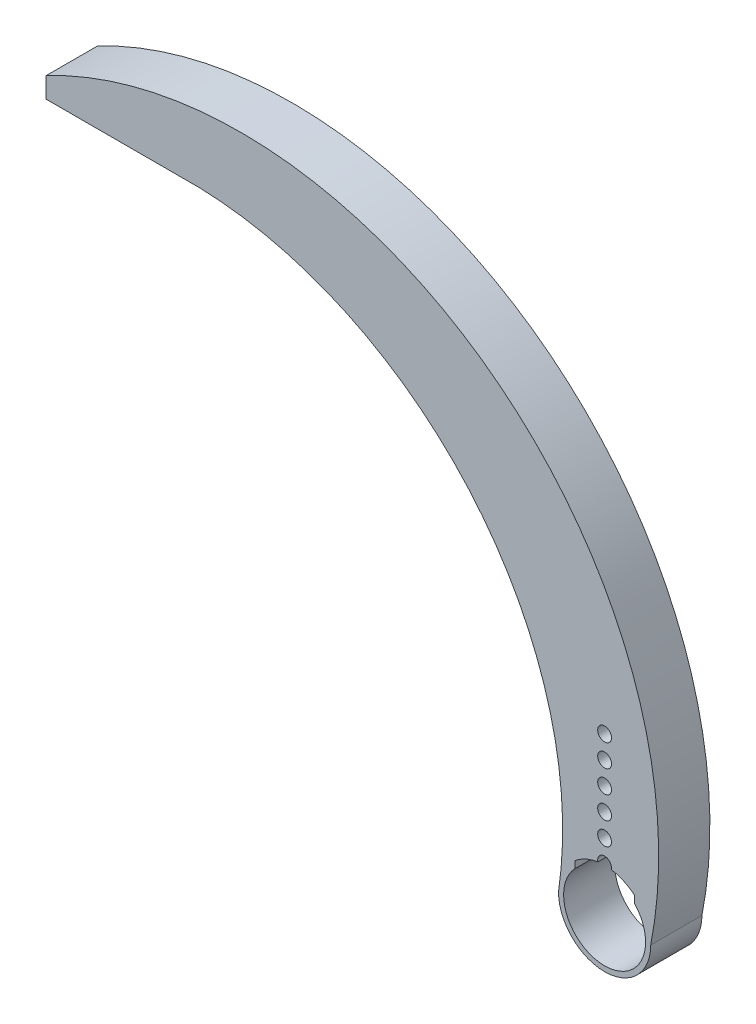
ISO-10303-21;
HEADER;
FILE_DESCRIPTION(('STEP AP214'),'2;1');
FILE_NAME('part.step','',(''),(''),'','','');
FILE_SCHEMA(('AUTOMOTIVE_DESIGN { 1 0 10303 214 1 1 1 1 }'));
ENDSEC;
DATA;
#1=APPLICATION_CONTEXT('core data for automotive mechanical design processes');
#2=APPLICATION_PROTOCOL_DEFINITION('international standard','automotive_design',2000,#1);
#3=PRODUCT_CONTEXT('',#1,'mechanical');
#4=PRODUCT('Part','Part','',(#3));
#5=PRODUCT_RELATED_PRODUCT_CATEGORY('part','',(#4));
#6=PRODUCT_DEFINITION_FORMATION('','',#4);
#7=PRODUCT_DEFINITION_CONTEXT('part definition',#1,'design');
#8=PRODUCT_DEFINITION('design','',#6,#7);
#9=PRODUCT_DEFINITION_SHAPE('','',#8);
#10=(LENGTH_UNIT() NAMED_UNIT(*) SI_UNIT(.MILLI.,.METRE.));
#11=(NAMED_UNIT(*) PLANE_ANGLE_UNIT() SI_UNIT($,.RADIAN.));
#12=(NAMED_UNIT(*) SI_UNIT($,.STERADIAN.) SOLID_ANGLE_UNIT());
#13=UNCERTAINTY_MEASURE_WITH_UNIT(LENGTH_MEASURE(1.E-05),#10,'distance_accuracy_value','');
#14=(GEOMETRIC_REPRESENTATION_CONTEXT(3) GLOBAL_UNCERTAINTY_ASSIGNED_CONTEXT((#13)) GLOBAL_UNIT_ASSIGNED_CONTEXT((#10,
#11,#12)) REPRESENTATION_CONTEXT('',''));
#15=CARTESIAN_POINT('',(0.,0.,0.));
#16=DIRECTION('',(0.,0.,1.));
#17=DIRECTION('',(1.,0.,0.));
#18=AXIS2_PLACEMENT_3D('',#15,#16,#17);
#19=CARTESIAN_POINT('',(2.90000010022773,1.12208217675132E-07,5.));
#20=DIRECTION('',(-0.999999999999999,-3.86924875162317E-08,0.));
#21=DIRECTION('',(3.86924875162317E-08,-0.999999999999999,0.));
#22=AXIS2_PLACEMENT_3D('',#19,#20,#21);
#23=PLANE('',#22);
#24=DIRECTION('',(-3.86924875162317E-08,0.999999999999999,0.));
#25=VECTOR('',#24,1.);
#26=CARTESIAN_POINT('',(2.90000010022773,1.12208217675132E-07,5.));
#27=LINE('',#26,#25);
#28=CARTESIAN_POINT('',(2.89999999363011,2.75499546949634,5.));
#29=VERTEX_POINT('',#28);
#30=CARTESIAN_POINT('',(2.89999996708959,3.44093013455379,5.));
#31=VERTEX_POINT('',#30);
#32=EDGE_CURVE('E338',#29,#31,#27,.T.);
#33=ORIENTED_EDGE('',*,*,#32,.T.);
#34=DIRECTION('',(0.,0.,1.));
#35=VECTOR('',#34,1.);
#36=CARTESIAN_POINT('',(2.89999996708959,3.44093013455379,2.5));
#37=LINE('',#36,#35);
#38=CARTESIAN_POINT('',(2.89999996708959,3.4409300790803,2.5));
#39=VERTEX_POINT('',#38);
#40=EDGE_CURVE('E193',#39,#31,#37,.T.);
#41=ORIENTED_EDGE('',*,*,#40,.F.);
#42=DIRECTION('',(3.86924875162317E-08,-0.999999999999999,0.));
#43=VECTOR('',#42,1.);
#44=CARTESIAN_POINT('',(2.90000010022773,1.12208217675132E-07,2.5));
#45=LINE('',#44,#43);
#46=CARTESIAN_POINT('',(2.89999996061248,3.60832972665632,2.5));
#47=VERTEX_POINT('',#46);
#48=EDGE_CURVE('E293',#47,#39,#45,.T.);
#49=ORIENTED_EDGE('',*,*,#48,.F.);
#50=DIRECTION('',(0.,0.,-1.));
#51=VECTOR('',#50,1.);
#52=CARTESIAN_POINT('',(2.89999996061248,3.60832972665632,5.));
#53=LINE('',#52,#51);
#54=CARTESIAN_POINT('',(2.89999996061248,3.60832972665632,0.));
#55=VERTEX_POINT('',#54);
#56=EDGE_CURVE('E367',#47,#55,#53,.T.);
#57=ORIENTED_EDGE('',*,*,#56,.T.);
#58=DIRECTION('',(-3.86924875162317E-08,0.999999999999999,0.));
#59=VECTOR('',#58,1.);
#60=CARTESIAN_POINT('',(2.90000010022773,1.12208217675132E-07,0.));
#61=LINE('',#60,#59);
#62=CARTESIAN_POINT('',(2.89999999363011,2.75499546949634,0.));
#63=VERTEX_POINT('',#62);
#64=EDGE_CURVE('E337',#63,#55,#61,.T.);
#65=ORIENTED_EDGE('',*,*,#64,.F.);
#66=DIRECTION('',(0.,0.,-1.));
#67=VECTOR('',#66,1.);
#68=CARTESIAN_POINT('',(2.89999999363011,2.75499546949634,5.));
#69=LINE('',#68,#67);
#70=EDGE_CURVE('E179',#29,#63,#69,.T.);
#71=ORIENTED_EDGE('',*,*,#70,.F.);
#72=EDGE_LOOP('',(#33,#41,#49,#57,#65,#71));
#73=FACE_BOUND('',#72,.T.);
#74=ADVANCED_FACE('F176',(#73),#23,.T.);
#75=CARTESIAN_POINT('',(-2.89999989977228,-1.12208202649701E-07,5.));
#76=DIRECTION('',(0.999999999999999,3.86924850095727E-08,0.));
#77=DIRECTION('',(-3.86924850095727E-08,0.999999999999999,0.));
#78=AXIS2_PLACEMENT_3D('',#75,#76,#77);
#79=PLANE('',#78);
#80=DIRECTION('',(-3.86924850095727E-08,0.999999999999999,0.));
#81=VECTOR('',#80,1.);
#82=CARTESIAN_POINT('',(-2.89999989977228,-1.12208202649701E-07,2.5));
#83=LINE('',#82,#81);
#84=CARTESIAN_POINT('',(-2.90000003291042,3.4409300790803,2.5));
#85=VERTEX_POINT('',#84);
#86=CARTESIAN_POINT('',(-2.90000003938752,3.6083297124865,2.5));
#87=VERTEX_POINT('',#86);
#88=EDGE_CURVE('E201',#85,#87,#83,.T.);
#89=ORIENTED_EDGE('',*,*,#88,.F.);
#90=DIRECTION('',(0.,0.,1.));
#91=VECTOR('',#90,1.);
#92=CARTESIAN_POINT('',(-2.90000003291042,3.4409300790803,2.5));
#93=LINE('',#92,#91);
#94=CARTESIAN_POINT('',(-2.90000003291042,3.4409300790803,5.));
#95=VERTEX_POINT('',#94);
#96=EDGE_CURVE('E319',#85,#95,#93,.T.);
#97=ORIENTED_EDGE('',*,*,#96,.T.);
#98=DIRECTION('',(3.86924850095727E-08,-0.999999999999999,0.));
#99=VECTOR('',#98,1.);
#100=CARTESIAN_POINT('',(-2.89999989977228,-1.12208202649701E-07,5.));
#101=LINE('',#100,#99);
#102=CARTESIAN_POINT('',(-2.9000000063699,2.75499545608601,5.));
#103=VERTEX_POINT('',#102);
#104=EDGE_CURVE('E346',#95,#103,#101,.T.);
#105=ORIENTED_EDGE('',*,*,#104,.T.);
#106=DIRECTION('',(0.,0.,-1.));
#107=VECTOR('',#106,1.);
#108=CARTESIAN_POINT('',(-2.9000000063699,2.75499545608601,5.));
#109=LINE('',#108,#107);
#110=CARTESIAN_POINT('',(-2.9000000063699,2.75499545608601,0.));
#111=VERTEX_POINT('',#110);
#112=EDGE_CURVE('E432',#103,#111,#109,.T.);
#113=ORIENTED_EDGE('',*,*,#112,.T.);
#114=DIRECTION('',(3.86924850095727E-08,-0.999999999999999,0.));
#115=VECTOR('',#114,1.);
#116=CARTESIAN_POINT('',(-2.89999989977228,-1.12208202649701E-07,0.));
#117=LINE('',#116,#115);
#118=CARTESIAN_POINT('',(-2.90000003938752,3.6083297124865,0.));
#119=VERTEX_POINT('',#118);
#120=EDGE_CURVE('E375',#119,#111,#117,.T.);
#121=ORIENTED_EDGE('',*,*,#120,.F.);
#122=DIRECTION('',(0.,0.,-1.));
#123=VECTOR('',#122,1.);
#124=CARTESIAN_POINT('',(-2.90000003938752,3.6083297124865,5.));
#125=LINE('',#124,#123);
#126=EDGE_CURVE('E430',#87,#119,#125,.T.);
#127=ORIENTED_EDGE('',*,*,#126,.F.);
#128=EDGE_LOOP('',(#89,#97,#105,#113,#121,#127));
#129=FACE_BOUND('',#128,.T.);
#130=ADVANCED_FACE('F449',(#129),#79,.T.);
#131=CARTESIAN_POINT('',(-3.04506055819265,0.126877533171024,5.));
#132=DIRECTION('',(0.999133072957061,-0.0416305479591573,0.));
#133=DIRECTION('',(0.0416305479591573,0.999133072957061,0.));
#134=AXIS2_PLACEMENT_3D('',#131,#132,#133);
#135=PLANE('',#134);
#136=DIRECTION('',(0.,0.,-1.));
#137=VECTOR('',#136,1.);
#138=CARTESIAN_POINT('',(-2.3999841987356,15.6087089505378,5.));
#139=LINE('',#138,#137);
#140=CARTESIAN_POINT('',(-2.3999841987356,15.6087089505378,2.5));
#141=VERTEX_POINT('',#140);
#142=CARTESIAN_POINT('',(-2.3999841987356,15.6087089505378,0.));
#143=VERTEX_POINT('',#142);
#144=EDGE_CURVE('E427',#141,#143,#139,.T.);
#145=ORIENTED_EDGE('',*,*,#144,.F.);
#146=DIRECTION('',(0.0416305479591573,0.999133072957061,0.));
#147=VECTOR('',#146,1.);
#148=CARTESIAN_POINT('',(-3.04506055819264,0.126877533171024,2.5));
#149=LINE('',#148,#147);
#150=EDGE_CURVE('E330',#87,#141,#149,.T.);
#151=ORIENTED_EDGE('',*,*,#150,.F.);
#152=ORIENTED_EDGE('',*,*,#126,.T.);
#153=DIRECTION('',(-0.0416305479591573,-0.999133072957061,0.));
#154=VECTOR('',#153,1.);
#155=CARTESIAN_POINT('',(-3.04506055819265,0.126877533171024,0.));
#156=LINE('',#155,#154);
#157=EDGE_CURVE('E379',#143,#119,#156,.T.);
#158=ORIENTED_EDGE('',*,*,#157,.F.);
#159=EDGE_LOOP('',(#145,#151,#152,#158));
#160=FACE_BOUND('',#159,.T.);
#161=ADVANCED_FACE('F510',(#160),#135,.T.);
#162=CARTESIAN_POINT('',(0.,15.6,5.));
#163=DIRECTION('',(0.,0.,-1.));
#164=DIRECTION('',(-1.,0.,0.));
#165=AXIS2_PLACEMENT_3D('',#162,#163,#164);
#166=CYLINDRICAL_SURFACE('',#165,2.4);
#167=DIRECTION('',(0.,0.,-1.));
#168=VECTOR('',#167,1.);
#169=CARTESIAN_POINT('',(2.39998419874053,15.6087089491782,5.));
#170=LINE('',#169,#168);
#171=CARTESIAN_POINT('',(2.39998419874053,15.6087089491782,2.5));
#172=VERTEX_POINT('',#171);
#173=CARTESIAN_POINT('',(2.39998419874053,15.6087089491782,0.));
#174=VERTEX_POINT('',#173);
#175=EDGE_CURVE('E424',#172,#174,#170,.T.);
#176=ORIENTED_EDGE('',*,*,#175,.F.);
#177=CARTESIAN_POINT('',(0.,15.6,2.5));
#178=DIRECTION('',(0.,0.,1.));
#179=DIRECTION('',(1.,0.,0.));
#180=AXIS2_PLACEMENT_3D('',#177,#178,#179);
#181=CIRCLE('',#180,2.4);
#182=EDGE_CURVE('E497',#172,#141,#181,.T.);
#183=ORIENTED_EDGE('',*,*,#182,.T.);
#184=ORIENTED_EDGE('',*,*,#144,.T.);
#185=CARTESIAN_POINT('',(0.,15.6,0.));
#186=DIRECTION('',(0.,0.,1.));
#187=DIRECTION('',(1.,0.,0.));
#188=AXIS2_PLACEMENT_3D('',#185,#186,#187);
#189=CIRCLE('',#188,2.4);
#190=EDGE_CURVE('E383',#174,#143,#189,.T.);
#191=ORIENTED_EDGE('',*,*,#190,.F.);
#192=EDGE_LOOP('',(#176,#183,#184,#191));
#193=FACE_BOUND('',#192,.T.);
#194=ADVANCED_FACE('F508',(#193),#166,.F.);
#195=CARTESIAN_POINT('',(3.04506045834017,0.12687750918451,5.));
#196=DIRECTION('',(-0.999133073227643,-0.0416305414652054,0.));
#197=DIRECTION('',(0.0416305414652054,-0.999133073227643,0.));
#198=AXIS2_PLACEMENT_3D('',#195,#196,#197);
#199=PLANE('',#198);
#200=ORIENTED_EDGE('',*,*,#56,.F.);
#201=DIRECTION('',(0.0416305414652054,-0.999133073227643,0.));
#202=VECTOR('',#201,1.);
#203=CARTESIAN_POINT('',(3.04506045834017,0.12687750918451,2.5));
#204=LINE('',#203,#202);
#205=EDGE_CURVE('E500',#172,#47,#204,.T.);
#206=ORIENTED_EDGE('',*,*,#205,.F.);
#207=ORIENTED_EDGE('',*,*,#175,.T.);
#208=DIRECTION('',(-0.0416305414652054,0.999133073227643,0.));
#209=VECTOR('',#208,1.);
#210=CARTESIAN_POINT('',(3.04506045834017,0.12687750918451,0.));
#211=LINE('',#210,#209);
#212=EDGE_CURVE('E387',#55,#174,#211,.T.);
#213=ORIENTED_EDGE('',*,*,#212,.F.);
#214=EDGE_LOOP('',(#200,#206,#207,#213));
#215=FACE_BOUND('',#214,.T.);
#216=ADVANCED_FACE('F505',(#215),#199,.T.);
#217=CARTESIAN_POINT('',(-35.4928250448354,7.93007550806156,5.));
#218=DIRECTION('',(0.,0.,-1.));
#219=DIRECTION('',(-1.,0.,0.));
#220=AXIS2_PLACEMENT_3D('',#217,#218,#219);
#221=CYLINDRICAL_SURFACE('',#220,40.7714624784343);
#222=CARTESIAN_POINT('',(-35.4928250448354,7.93007550806156,0.));
#223=DIRECTION('',(0.,0.,1.));
#224=DIRECTION('',(1.,0.,0.));
#225=AXIS2_PLACEMENT_3D('',#222,#223,#224);
#226=CIRCLE('',#225,40.7714624784343);
#227=CARTESIAN_POINT('',(-54.5,44.,0.));
#228=VERTEX_POINT('',#227);
#229=CARTESIAN_POINT('',(4.5,0.,0.));
#230=VERTEX_POINT('',#229);
#231=EDGE_CURVE('E391',#228,#230,#226,.F.);
#232=ORIENTED_EDGE('',*,*,#231,.F.);
#233=DIRECTION('',(0.,0.,-1.));
#234=VECTOR('',#233,1.);
#235=CARTESIAN_POINT('',(-54.5,44.,5.));
#236=LINE('',#235,#234);
#237=CARTESIAN_POINT('',(-54.5,44.,5.));
#238=VERTEX_POINT('',#237);
#239=EDGE_CURVE('E12',#238,#228,#236,.T.);
#240=ORIENTED_EDGE('',*,*,#239,.F.);
#241=CARTESIAN_POINT('',(-35.4928250448354,7.93007550806156,5.));
#242=DIRECTION('',(0.,0.,1.));
#243=DIRECTION('',(1.,0.,0.));
#244=AXIS2_PLACEMENT_3D('',#241,#242,#243);
#245=CIRCLE('',#244,40.7714624784343);
#246=CARTESIAN_POINT('',(4.5,0.,5.));
#247=VERTEX_POINT('',#246);
#248=EDGE_CURVE('E349',#238,#247,#245,.F.);
#249=ORIENTED_EDGE('',*,*,#248,.T.);
#250=DIRECTION('',(0.,0.,-1.));
#251=VECTOR('',#250,1.);
#252=CARTESIAN_POINT('',(4.5,0.,5.));
#253=LINE('',#252,#251);
#254=EDGE_CURVE('E410',#247,#230,#253,.T.);
#255=ORIENTED_EDGE('',*,*,#254,.T.);
#256=EDGE_LOOP('',(#232,#240,#249,#255));
#257=FACE_BOUND('',#256,.T.);
#258=ADVANCED_FACE('F546',(#257),#221,.T.);
#259=CARTESIAN_POINT('',(-54.5,0.,5.));
#260=DIRECTION('',(1.,0.,0.));
#261=DIRECTION('',(0.,0.,-1.));
#262=AXIS2_PLACEMENT_3D('',#259,#260,#261);
#263=PLANE('',#262);
#264=DIRECTION('',(0.,-1.,0.));
#265=VECTOR('',#264,1.);
#266=CARTESIAN_POINT('',(-54.5,0.,0.));
#267=LINE('',#266,#265);
#268=CARTESIAN_POINT('',(-54.5,42.,0.));
#269=VERTEX_POINT('',#268);
#270=EDGE_CURVE('E395',#228,#269,#267,.T.);
#271=ORIENTED_EDGE('',*,*,#270,.T.);
#272=DIRECTION('',(0.,0.,-1.));
#273=VECTOR('',#272,1.);
#274=CARTESIAN_POINT('',(-54.5,42.,5.));
#275=LINE('',#274,#273);
#276=CARTESIAN_POINT('',(-54.5,42.,5.));
#277=VERTEX_POINT('',#276);
#278=EDGE_CURVE('E185',#277,#269,#275,.T.);
#279=ORIENTED_EDGE('',*,*,#278,.F.);
#280=DIRECTION('',(0.,-1.,0.));
#281=VECTOR('',#280,1.);
#282=CARTESIAN_POINT('',(-54.5,0.,5.));
#283=LINE('',#282,#281);
#284=EDGE_CURVE('E353',#238,#277,#283,.T.);
#285=ORIENTED_EDGE('',*,*,#284,.F.);
#286=ORIENTED_EDGE('',*,*,#239,.T.);
#287=EDGE_LOOP('',(#271,#279,#285,#286));
#288=FACE_BOUND('',#287,.T.);
#289=ADVANCED_FACE('F658',(#288),#263,.F.);
#290=CARTESIAN_POINT('',(0.,42.,5.));
#291=DIRECTION('',(0.,-1.,0.));
#292=DIRECTION('',(0.,0.,-1.));
#293=AXIS2_PLACEMENT_3D('',#290,#291,#292);
#294=PLANE('',#293);
#295=DIRECTION('',(-1.,0.,0.));
#296=VECTOR('',#295,1.);
#297=CARTESIAN_POINT('',(0.,42.,0.));
#298=LINE('',#297,#296);
#299=CARTESIAN_POINT('',(-39.5,42.,0.));
#300=VERTEX_POINT('',#299);
#301=EDGE_CURVE('E399',#300,#269,#298,.T.);
#302=ORIENTED_EDGE('',*,*,#301,.F.);
#303=DIRECTION('',(0.,0.,-1.));
#304=VECTOR('',#303,1.);
#305=CARTESIAN_POINT('',(-39.5,42.,5.));
#306=LINE('',#305,#304);
#307=CARTESIAN_POINT('',(-39.5,42.,5.));
#308=VERTEX_POINT('',#307);
#309=EDGE_CURVE('E417',#308,#300,#306,.T.);
#310=ORIENTED_EDGE('',*,*,#309,.F.);
#311=DIRECTION('',(-1.,0.,0.));
#312=VECTOR('',#311,1.);
#313=CARTESIAN_POINT('',(0.,42.,5.));
#314=LINE('',#313,#312);
#315=EDGE_CURVE('E356',#308,#277,#314,.T.);
#316=ORIENTED_EDGE('',*,*,#315,.T.);
#317=ORIENTED_EDGE('',*,*,#278,.T.);
#318=EDGE_LOOP('',(#302,#310,#316,#317));
#319=FACE_BOUND('',#318,.T.);
#320=ADVANCED_FACE('F654',(#319),#294,.T.);
#321=CARTESIAN_POINT('',(-40.6705070030768,5.44124416410263,5.));
#322=DIRECTION('',(0.,0.,-1.));
#323=DIRECTION('',(-1.,0.,0.));
#324=AXIS2_PLACEMENT_3D('',#321,#322,#323);
#325=CYLINDRICAL_SURFACE('',#324,36.5774891827338);
#326=CARTESIAN_POINT('',(-40.6705070030768,5.44124416410263,0.));
#327=DIRECTION('',(0.,0.,1.));
#328=DIRECTION('',(1.,0.,0.));
#329=AXIS2_PLACEMENT_3D('',#326,#327,#328);
#330=CIRCLE('',#329,36.5774891827338);
#331=CARTESIAN_POINT('',(-4.5,0.,0.));
#332=VERTEX_POINT('',#331);
#333=EDGE_CURVE('E403',#300,#332,#330,.F.);
#334=ORIENTED_EDGE('',*,*,#333,.T.);
#335=DIRECTION('',(0.,0.,-1.));
#336=VECTOR('',#335,1.);
#337=CARTESIAN_POINT('',(-4.5,0.,5.));
#338=LINE('',#337,#336);
#339=CARTESIAN_POINT('',(-4.5,0.,5.));
#340=VERTEX_POINT('',#339);
#341=EDGE_CURVE('E413',#340,#332,#338,.T.);
#342=ORIENTED_EDGE('',*,*,#341,.F.);
#343=CARTESIAN_POINT('',(-40.6705070030768,5.44124416410263,5.));
#344=DIRECTION('',(0.,0.,1.));
#345=DIRECTION('',(1.,0.,0.));
#346=AXIS2_PLACEMENT_3D('',#343,#344,#345);
#347=CIRCLE('',#346,36.5774891827338);
#348=EDGE_CURVE('E360',#308,#340,#347,.F.);
#349=ORIENTED_EDGE('',*,*,#348,.F.);
#350=ORIENTED_EDGE('',*,*,#309,.T.);
#351=EDGE_LOOP('',(#334,#342,#349,#350));
#352=FACE_BOUND('',#351,.T.);
#353=ADVANCED_FACE('F651',(#352),#325,.F.);
#354=CARTESIAN_POINT('',(0.,0.,5.));
#355=DIRECTION('',(0.,0.,-1.));
#356=DIRECTION('',(-1.,0.,0.));
#357=AXIS2_PLACEMENT_3D('',#354,#355,#356);
#358=CYLINDRICAL_SURFACE('',#357,4.);
#359=CARTESIAN_POINT('',(0.,0.,0.));
#360=DIRECTION('',(0.,0.,1.));
#361=DIRECTION('',(1.,0.,0.));
#362=AXIS2_PLACEMENT_3D('',#359,#360,#361);
#363=CIRCLE('',#362,4.);
#364=EDGE_CURVE('E371',#111,#63,#363,.T.);
#365=ORIENTED_EDGE('',*,*,#364,.F.);
#366=ORIENTED_EDGE('',*,*,#112,.F.);
#367=CARTESIAN_POINT('',(0.,0.,5.));
#368=DIRECTION('',(0.,0.,1.));
#369=DIRECTION('',(1.,0.,0.));
#370=AXIS2_PLACEMENT_3D('',#367,#368,#369);
#371=CIRCLE('',#370,4.);
#372=EDGE_CURVE('E341',#103,#29,#371,.T.);
#373=ORIENTED_EDGE('',*,*,#372,.T.);
#374=ORIENTED_EDGE('',*,*,#70,.T.);
#375=EDGE_LOOP('',(#365,#366,#373,#374));
#376=FACE_BOUND('',#375,.T.);
#377=ADVANCED_FACE('F440',(#376),#358,.F.);
#378=CARTESIAN_POINT('',(0.,0.,5.));
#379=DIRECTION('',(0.,0.,-1.));
#380=DIRECTION('',(-1.,0.,0.));
#381=AXIS2_PLACEMENT_3D('',#378,#379,#380);
#382=CYLINDRICAL_SURFACE('',#381,4.5);
#383=CARTESIAN_POINT('',(0.,0.,0.));
#384=DIRECTION('',(0.,0.,1.));
#385=DIRECTION('',(1.,0.,0.));
#386=AXIS2_PLACEMENT_3D('',#383,#384,#385);
#387=CIRCLE('',#386,4.5);
#388=EDGE_CURVE('E342',#332,#230,#387,.T.);
#389=ORIENTED_EDGE('',*,*,#388,.T.);
#390=ORIENTED_EDGE('',*,*,#254,.F.);
#391=CARTESIAN_POINT('',(0.,0.,5.));
#392=DIRECTION('',(0.,0.,1.));
#393=DIRECTION('',(1.,0.,0.));
#394=AXIS2_PLACEMENT_3D('',#391,#392,#393);
#395=CIRCLE('',#394,4.5);
#396=EDGE_CURVE('E364',#340,#247,#395,.T.);
#397=ORIENTED_EDGE('',*,*,#396,.F.);
#398=ORIENTED_EDGE('',*,*,#341,.T.);
#399=EDGE_LOOP('',(#389,#390,#397,#398));
#400=FACE_BOUND('',#399,.T.);
#401=ADVANCED_FACE('F460',(#400),#382,.T.);
#402=CARTESIAN_POINT('',(0.,0.,5.));
#403=DIRECTION('',(0.,0.,1.));
#404=DIRECTION('',(1.,0.,0.));
#405=AXIS2_PLACEMENT_3D('',#402,#403,#404);
#406=PLANE('',#405);
#407=CARTESIAN_POINT('',(0.,0.,5.));
#408=DIRECTION('',(0.,0.,1.));
#409=DIRECTION('',(1.,0.,0.));
#410=AXIS2_PLACEMENT_3D('',#407,#408,#409);
#411=CIRCLE('',#410,4.5);
#412=CARTESIAN_POINT('',(0.658476505726479,4.4515625,5.));
#413=VERTEX_POINT('',#412);
#414=EDGE_CURVE('E301',#31,#413,#411,.T.);
#415=ORIENTED_EDGE('',*,*,#414,.F.);
#416=ORIENTED_EDGE('',*,*,#32,.F.);
#417=ORIENTED_EDGE('',*,*,#372,.F.);
#418=ORIENTED_EDGE('',*,*,#104,.F.);
#419=CARTESIAN_POINT('',(0.,0.,5.));
#420=DIRECTION('',(0.,0.,1.));
#421=DIRECTION('',(1.,0.,0.));
#422=AXIS2_PLACEMENT_3D('',#419,#420,#421);
#423=CIRCLE('',#422,4.5);
#424=CARTESIAN_POINT('',(-0.658476505726479,4.4515625,5.));
#425=VERTEX_POINT('',#424);
#426=EDGE_CURVE('E326',#425,#95,#423,.T.);
#427=ORIENTED_EDGE('',*,*,#426,.F.);
#428=CARTESIAN_POINT('',(0.,4.6,5.));
#429=DIRECTION('',(0.,0.,1.));
#430=DIRECTION('',(1.,0.,0.));
#431=AXIS2_PLACEMENT_3D('',#428,#429,#430);
#432=CIRCLE('',#431,0.675000000000003);
#433=EDGE_CURVE('E322',#413,#425,#432,.T.);
#434=ORIENTED_EDGE('',*,*,#433,.F.);
#435=EDGE_LOOP('',(#415,#416,#417,#418,#427,#434));
#436=FACE_BOUND('',#435,.T.);
#437=ORIENTED_EDGE('',*,*,#248,.F.);
#438=ORIENTED_EDGE('',*,*,#284,.T.);
#439=ORIENTED_EDGE('',*,*,#315,.F.);
#440=ORIENTED_EDGE('',*,*,#348,.T.);
#441=ORIENTED_EDGE('',*,*,#396,.T.);
#442=EDGE_LOOP('',(#437,#438,#439,#440,#441));
#443=FACE_BOUND('',#442,.T.);
#444=CARTESIAN_POINT('',(0.,15.6,5.));
#445=DIRECTION('',(0.,0.,1.));
#446=DIRECTION('',(1.,0.,0.));
#447=AXIS2_PLACEMENT_3D('',#444,#445,#446);
#448=CIRCLE('',#447,0.675000000000002);
#449=CARTESIAN_POINT('',(0.675000000000002,15.6,5.));
#450=VERTEX_POINT('',#449);
#451=EDGE_CURVE('E467',#450,#450,#448,.T.);
#452=ORIENTED_EDGE('',*,*,#451,.F.);
#453=EDGE_LOOP('',(#452));
#454=FACE_BOUND('',#453,.T.);
#455=CARTESIAN_POINT('',(0.,6.8,5.));
#456=DIRECTION('',(0.,0.,1.));
#457=DIRECTION('',(1.,0.,0.));
#458=AXIS2_PLACEMENT_3D('',#455,#456,#457);
#459=CIRCLE('',#458,0.674999999999995);
#460=CARTESIAN_POINT('',(0.674999999999995,6.8,5.));
#461=VERTEX_POINT('',#460);
#462=EDGE_CURVE('E471',#461,#461,#459,.T.);
#463=ORIENTED_EDGE('',*,*,#462,.F.);
#464=EDGE_LOOP('',(#463));
#465=FACE_BOUND('',#464,.T.);
#466=CARTESIAN_POINT('',(0.,9.,5.));
#467=DIRECTION('',(0.,0.,1.));
#468=DIRECTION('',(1.,0.,0.));
#469=AXIS2_PLACEMENT_3D('',#466,#467,#468);
#470=CIRCLE('',#469,0.675000000000002);
#471=CARTESIAN_POINT('',(0.675000000000002,9.,5.));
#472=VERTEX_POINT('',#471);
#473=EDGE_CURVE('E475',#472,#472,#470,.T.);
#474=ORIENTED_EDGE('',*,*,#473,.F.);
#475=EDGE_LOOP('',(#474));
#476=FACE_BOUND('',#475,.T.);
#477=CARTESIAN_POINT('',(0.,11.2,5.));
#478=DIRECTION('',(0.,0.,1.));
#479=DIRECTION('',(1.,0.,0.));
#480=AXIS2_PLACEMENT_3D('',#477,#478,#479);
#481=CIRCLE('',#480,0.675000000000002);
#482=CARTESIAN_POINT('',(0.675000000000002,11.2,5.));
#483=VERTEX_POINT('',#482);
#484=EDGE_CURVE('E479',#483,#483,#481,.T.);
#485=ORIENTED_EDGE('',*,*,#484,.F.);
#486=EDGE_LOOP('',(#485));
#487=FACE_BOUND('',#486,.T.);
#488=CARTESIAN_POINT('',(0.,13.4,5.));
#489=DIRECTION('',(0.,0.,1.));
#490=DIRECTION('',(1.,0.,0.));
#491=AXIS2_PLACEMENT_3D('',#488,#489,#490);
#492=CIRCLE('',#491,0.675000000000002);
#493=CARTESIAN_POINT('',(0.675000000000002,13.4,5.));
#494=VERTEX_POINT('',#493);
#495=EDGE_CURVE('E482',#494,#494,#492,.T.);
#496=ORIENTED_EDGE('',*,*,#495,.F.);
#497=EDGE_LOOP('',(#496));
#498=FACE_BOUND('',#497,.T.);
#499=ADVANCED_FACE('F457',(#436,#443,#454,#465,#476,#487,#498),#406,.T.);
#500=CARTESIAN_POINT('',(0.,0.,0.));
#501=DIRECTION('',(0.,0.,1.));
#502=DIRECTION('',(1.,0.,0.));
#503=AXIS2_PLACEMENT_3D('',#500,#501,#502);
#504=PLANE('',#503);
#505=ORIENTED_EDGE('',*,*,#64,.T.);
#506=ORIENTED_EDGE('',*,*,#212,.T.);
#507=ORIENTED_EDGE('',*,*,#190,.T.);
#508=ORIENTED_EDGE('',*,*,#157,.T.);
#509=ORIENTED_EDGE('',*,*,#120,.T.);
#510=ORIENTED_EDGE('',*,*,#364,.T.);
#511=EDGE_LOOP('',(#505,#506,#507,#508,#509,#510));
#512=FACE_BOUND('',#511,.T.);
#513=ORIENTED_EDGE('',*,*,#231,.T.);
#514=ORIENTED_EDGE('',*,*,#388,.F.);
#515=ORIENTED_EDGE('',*,*,#333,.F.);
#516=ORIENTED_EDGE('',*,*,#301,.T.);
#517=ORIENTED_EDGE('',*,*,#270,.F.);
#518=EDGE_LOOP('',(#513,#514,#515,#516,#517));
#519=FACE_BOUND('',#518,.T.);
#520=ADVANCED_FACE('F446',(#512,#519),#504,.F.);
#521=CARTESIAN_POINT('',(0.,0.,2.5));
#522=DIRECTION('',(0.,0.,1.));
#523=DIRECTION('',(1.,0.,0.));
#524=AXIS2_PLACEMENT_3D('',#521,#522,#523);
#525=CYLINDRICAL_SURFACE('',#524,4.5);
#526=ORIENTED_EDGE('',*,*,#414,.T.);
#527=DIRECTION('',(0.,0.,1.));
#528=VECTOR('',#527,1.);
#529=CARTESIAN_POINT('',(0.658476505726479,4.4515625,2.5));
#530=LINE('',#529,#528);
#531=CARTESIAN_POINT('',(0.658476505726479,4.4515625,2.5));
#532=VERTEX_POINT('',#531);
#533=EDGE_CURVE('E298',#532,#413,#530,.T.);
#534=ORIENTED_EDGE('',*,*,#533,.F.);
#535=CARTESIAN_POINT('',(0.,0.,2.5));
#536=DIRECTION('',(0.,0.,1.));
#537=DIRECTION('',(1.,0.,0.));
#538=AXIS2_PLACEMENT_3D('',#535,#536,#537);
#539=CIRCLE('',#538,4.5);
#540=EDGE_CURVE('E285',#39,#532,#539,.T.);
#541=ORIENTED_EDGE('',*,*,#540,.F.);
#542=ORIENTED_EDGE('',*,*,#40,.T.);
#543=EDGE_LOOP('',(#526,#534,#541,#542));
#544=FACE_BOUND('',#543,.T.);
#545=ADVANCED_FACE('F299',(#544),#525,.F.);
#546=CARTESIAN_POINT('',(0.,4.6,2.5));
#547=DIRECTION('',(0.,0.,1.));
#548=DIRECTION('',(1.,0.,0.));
#549=AXIS2_PLACEMENT_3D('',#546,#547,#548);
#550=CYLINDRICAL_SURFACE('',#549,0.675000000000003);
#551=ORIENTED_EDGE('',*,*,#433,.T.);
#552=DIRECTION('',(0.,0.,1.));
#553=VECTOR('',#552,1.);
#554=CARTESIAN_POINT('',(-0.658476505726479,4.4515625,2.5));
#555=LINE('',#554,#553);
#556=CARTESIAN_POINT('',(-0.658476505726479,4.4515625,2.5));
#557=VERTEX_POINT('',#556);
#558=EDGE_CURVE('E305',#557,#425,#555,.T.);
#559=ORIENTED_EDGE('',*,*,#558,.F.);
#560=CARTESIAN_POINT('',(0.,4.6,2.5));
#561=DIRECTION('',(0.,0.,1.));
#562=DIRECTION('',(1.,0.,0.));
#563=AXIS2_PLACEMENT_3D('',#560,#561,#562);
#564=CIRCLE('',#563,0.675000000000003);
#565=EDGE_CURVE('E290',#532,#557,#564,.T.);
#566=ORIENTED_EDGE('',*,*,#565,.F.);
#567=ORIENTED_EDGE('',*,*,#533,.T.);
#568=EDGE_LOOP('',(#551,#559,#566,#567));
#569=FACE_BOUND('',#568,.T.);
#570=ADVANCED_FACE('F307',(#569),#550,.F.);
#571=CARTESIAN_POINT('',(0.,0.,2.5));
#572=DIRECTION('',(0.,0.,1.));
#573=DIRECTION('',(1.,0.,0.));
#574=AXIS2_PLACEMENT_3D('',#571,#572,#573);
#575=CYLINDRICAL_SURFACE('',#574,4.5);
#576=ORIENTED_EDGE('',*,*,#426,.T.);
#577=ORIENTED_EDGE('',*,*,#96,.F.);
#578=CARTESIAN_POINT('',(0.,0.,2.5));
#579=DIRECTION('',(0.,0.,1.));
#580=DIRECTION('',(1.,0.,0.));
#581=AXIS2_PLACEMENT_3D('',#578,#579,#580);
#582=CIRCLE('',#581,4.5);
#583=EDGE_CURVE('E311',#557,#85,#582,.T.);
#584=ORIENTED_EDGE('',*,*,#583,.F.);
#585=ORIENTED_EDGE('',*,*,#558,.T.);
#586=EDGE_LOOP('',(#576,#577,#584,#585));
#587=FACE_BOUND('',#586,.T.);
#588=ADVANCED_FACE('F454',(#587),#575,.F.);
#589=CARTESIAN_POINT('',(0.,15.6,2.5));
#590=DIRECTION('',(0.,0.,1.));
#591=DIRECTION('',(1.,0.,0.));
#592=AXIS2_PLACEMENT_3D('',#589,#590,#591);
#593=PLANE('',#592);
#594=CARTESIAN_POINT('',(0.,15.6,2.5));
#595=DIRECTION('',(0.,0.,1.));
#596=DIRECTION('',(1.,0.,0.));
#597=AXIS2_PLACEMENT_3D('',#594,#595,#596);
#598=CIRCLE('',#597,0.675000000000002);
#599=CARTESIAN_POINT('',(0.675000000000002,15.6,2.5));
#600=VERTEX_POINT('',#599);
#601=EDGE_CURVE('E747',#600,#600,#598,.T.);
#602=ORIENTED_EDGE('',*,*,#601,.T.);
#603=EDGE_LOOP('',(#602));
#604=FACE_BOUND('',#603,.T.);
#605=CARTESIAN_POINT('',(0.,6.8,2.5));
#606=DIRECTION('',(0.,0.,1.));
#607=DIRECTION('',(1.,0.,0.));
#608=AXIS2_PLACEMENT_3D('',#605,#606,#607);
#609=CIRCLE('',#608,0.674999999999995);
#610=CARTESIAN_POINT('',(0.674999999999995,6.8,2.5));
#611=VERTEX_POINT('',#610);
#612=EDGE_CURVE('E753',#611,#611,#609,.T.);
#613=ORIENTED_EDGE('',*,*,#612,.T.);
#614=EDGE_LOOP('',(#613));
#615=FACE_BOUND('',#614,.T.);
#616=CARTESIAN_POINT('',(0.,9.,2.5));
#617=DIRECTION('',(0.,0.,1.));
#618=DIRECTION('',(1.,0.,0.));
#619=AXIS2_PLACEMENT_3D('',#616,#617,#618);
#620=CIRCLE('',#619,0.675000000000002);
#621=CARTESIAN_POINT('',(0.675000000000002,9.,2.5));
#622=VERTEX_POINT('',#621);
#623=EDGE_CURVE('E759',#622,#622,#620,.T.);
#624=ORIENTED_EDGE('',*,*,#623,.T.);
#625=EDGE_LOOP('',(#624));
#626=FACE_BOUND('',#625,.T.);
#627=CARTESIAN_POINT('',(0.,11.2,2.5));
#628=DIRECTION('',(0.,0.,1.));
#629=DIRECTION('',(1.,0.,0.));
#630=AXIS2_PLACEMENT_3D('',#627,#628,#629);
#631=CIRCLE('',#630,0.675000000000002);
#632=CARTESIAN_POINT('',(0.675000000000002,11.2,2.5));
#633=VERTEX_POINT('',#632);
#634=EDGE_CURVE('E485',#633,#633,#631,.T.);
#635=ORIENTED_EDGE('',*,*,#634,.T.);
#636=EDGE_LOOP('',(#635));
#637=FACE_BOUND('',#636,.T.);
#638=CARTESIAN_POINT('',(0.,13.4,2.5));
#639=DIRECTION('',(0.,0.,1.));
#640=DIRECTION('',(1.,0.,0.));
#641=AXIS2_PLACEMENT_3D('',#638,#639,#640);
#642=CIRCLE('',#641,0.675000000000002);
#643=CARTESIAN_POINT('',(0.675000000000002,13.4,2.5));
#644=VERTEX_POINT('',#643);
#645=EDGE_CURVE('E323',#644,#644,#642,.T.);
#646=ORIENTED_EDGE('',*,*,#645,.T.);
#647=EDGE_LOOP('',(#646));
#648=FACE_BOUND('',#647,.T.);
#649=ORIENTED_EDGE('',*,*,#150,.T.);
#650=ORIENTED_EDGE('',*,*,#182,.F.);
#651=ORIENTED_EDGE('',*,*,#205,.T.);
#652=ORIENTED_EDGE('',*,*,#48,.T.);
#653=ORIENTED_EDGE('',*,*,#540,.T.);
#654=ORIENTED_EDGE('',*,*,#565,.T.);
#655=ORIENTED_EDGE('',*,*,#583,.T.);
#656=ORIENTED_EDGE('',*,*,#88,.T.);
#657=EDGE_LOOP('',(#649,#650,#651,#652,#653,#654,#655,#656));
#658=FACE_BOUND('',#657,.T.);
#659=ADVANCED_FACE('F288',(#604,#615,#626,#637,#648,#658),#593,.F.);
#660=CARTESIAN_POINT('',(0.,13.4,2.5));
#661=DIRECTION('',(0.,0.,1.));
#662=DIRECTION('',(1.,0.,0.));
#663=AXIS2_PLACEMENT_3D('',#660,#661,#662);
#664=CYLINDRICAL_SURFACE('',#663,0.675000000000002);
#665=ORIENTED_EDGE('',*,*,#645,.F.);
#666=EDGE_LOOP('',(#665));
#667=FACE_BOUND('',#666,.T.);
#668=ORIENTED_EDGE('',*,*,#495,.T.);
#669=EDGE_LOOP('',(#668));
#670=FACE_BOUND('',#669,.T.);
#671=ADVANCED_FACE('F591',(#667,#670),#664,.F.);
#672=CARTESIAN_POINT('',(0.,11.2,2.5));
#673=DIRECTION('',(0.,0.,1.));
#674=DIRECTION('',(1.,0.,0.));
#675=AXIS2_PLACEMENT_3D('',#672,#673,#674);
#676=CYLINDRICAL_SURFACE('',#675,0.675000000000002);
#677=ORIENTED_EDGE('',*,*,#634,.F.);
#678=EDGE_LOOP('',(#677));
#679=FACE_BOUND('',#678,.T.);
#680=ORIENTED_EDGE('',*,*,#484,.T.);
#681=EDGE_LOOP('',(#680));
#682=FACE_BOUND('',#681,.T.);
#683=ADVANCED_FACE('F601',(#679,#682),#676,.F.);
#684=CARTESIAN_POINT('',(0.,9.,2.5));
#685=DIRECTION('',(0.,0.,1.));
#686=DIRECTION('',(1.,0.,0.));
#687=AXIS2_PLACEMENT_3D('',#684,#685,#686);
#688=CYLINDRICAL_SURFACE('',#687,0.675000000000002);
#689=ORIENTED_EDGE('',*,*,#623,.F.);
#690=EDGE_LOOP('',(#689));
#691=FACE_BOUND('',#690,.T.);
#692=ORIENTED_EDGE('',*,*,#473,.T.);
#693=EDGE_LOOP('',(#692));
#694=FACE_BOUND('',#693,.T.);
#695=ADVANCED_FACE('F611',(#691,#694),#688,.F.);
#696=CARTESIAN_POINT('',(0.,6.8,2.5));
#697=DIRECTION('',(0.,0.,1.));
#698=DIRECTION('',(1.,0.,0.));
#699=AXIS2_PLACEMENT_3D('',#696,#697,#698);
#700=CYLINDRICAL_SURFACE('',#699,0.674999999999995);
#701=ORIENTED_EDGE('',*,*,#612,.F.);
#702=EDGE_LOOP('',(#701));
#703=FACE_BOUND('',#702,.T.);
#704=ORIENTED_EDGE('',*,*,#462,.T.);
#705=EDGE_LOOP('',(#704));
#706=FACE_BOUND('',#705,.T.);
#707=ADVANCED_FACE('F621',(#703,#706),#700,.F.);
#708=CARTESIAN_POINT('',(0.,15.6,2.5));
#709=DIRECTION('',(0.,0.,1.));
#710=DIRECTION('',(1.,0.,0.));
#711=AXIS2_PLACEMENT_3D('',#708,#709,#710);
#712=CYLINDRICAL_SURFACE('',#711,0.675000000000002);
#713=ORIENTED_EDGE('',*,*,#601,.F.);
#714=EDGE_LOOP('',(#713));
#715=FACE_BOUND('',#714,.T.);
#716=ORIENTED_EDGE('',*,*,#451,.T.);
#717=EDGE_LOOP('',(#716));
#718=FACE_BOUND('',#717,.T.);
#719=ADVANCED_FACE('F631',(#715,#718),#712,.F.);
#720=CLOSED_SHELL('',(#74,#130,#161,#194,#216,#258,#289,#320,#353,#377,#401,#499,#520,#545,#570,
#588,#659,#671,#683,#695,#707,#719));
#721=MANIFOLD_SOLID_BREP('B2',#720);
#722=ADVANCED_BREP_SHAPE_REPRESENTATION('',(#18,#721),#14);
#723=SHAPE_DEFINITION_REPRESENTATION(#9,#722);
ENDSEC;
END-ISO-10303-21;
